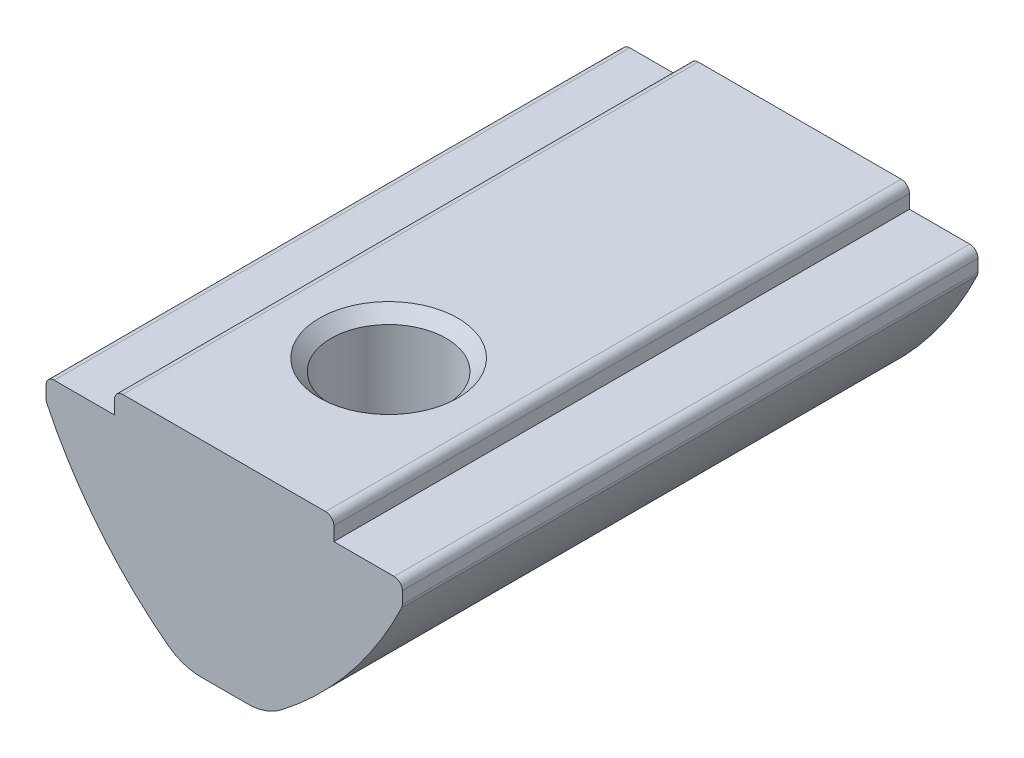
ISO-10303-21;
HEADER;
FILE_DESCRIPTION(('STEP AP214'),'2;1');
FILE_NAME('part.step','',(''),(''),'','','');
FILE_SCHEMA(('AUTOMOTIVE_DESIGN { 1 0 10303 214 1 1 1 1 }'));
ENDSEC;
DATA;
#1=APPLICATION_CONTEXT('core data for automotive mechanical design processes');
#2=APPLICATION_PROTOCOL_DEFINITION('international standard','automotive_design',2000,#1);
#3=PRODUCT_CONTEXT('',#1,'mechanical');
#4=PRODUCT('Part','Part','',(#3));
#5=PRODUCT_RELATED_PRODUCT_CATEGORY('part','',(#4));
#6=PRODUCT_DEFINITION_FORMATION('','',#4);
#7=PRODUCT_DEFINITION_CONTEXT('part definition',#1,'design');
#8=PRODUCT_DEFINITION('design','',#6,#7);
#9=PRODUCT_DEFINITION_SHAPE('','',#8);
#10=(LENGTH_UNIT() NAMED_UNIT(*) SI_UNIT(.MILLI.,.METRE.));
#11=(NAMED_UNIT(*) PLANE_ANGLE_UNIT() SI_UNIT($,.RADIAN.));
#12=(NAMED_UNIT(*) SI_UNIT($,.STERADIAN.) SOLID_ANGLE_UNIT());
#13=UNCERTAINTY_MEASURE_WITH_UNIT(LENGTH_MEASURE(1.E-05),#10,'distance_accuracy_value','');
#14=(GEOMETRIC_REPRESENTATION_CONTEXT(3) GLOBAL_UNCERTAINTY_ASSIGNED_CONTEXT((#13)) GLOBAL_UNIT_ASSIGNED_CONTEXT((#10,
#11,#12)) REPRESENTATION_CONTEXT('',''));
#15=CARTESIAN_POINT('',(0.,0.,0.));
#16=DIRECTION('',(0.,0.,1.));
#17=DIRECTION('',(1.,0.,0.));
#18=AXIS2_PLACEMENT_3D('',#15,#16,#17);
#19=CARTESIAN_POINT('',(-1.5,-7.5,10.5));
#20=DIRECTION('',(0.,1.,0.));
#21=DIRECTION('',(0.,0.,1.));
#22=AXIS2_PLACEMENT_3D('',#19,#20,#21);
#23=PLANE('',#22);
#24=DIRECTION('',(0.,0.,-1.));
#25=VECTOR('',#24,1.);
#26=CARTESIAN_POINT('',(0.84882059675723,-7.5,10.5));
#27=LINE('',#26,#25);
#28=CARTESIAN_POINT('',(0.84882059675723,-7.5,-10.5));
#29=VERTEX_POINT('',#28);
#30=CARTESIAN_POINT('',(0.84882059675723,-7.5,-7.85628300679493));
#31=VERTEX_POINT('',#30);
#32=EDGE_CURVE('E213',#29,#31,#27,.F.);
#33=ORIENTED_EDGE('',*,*,#32,.T.);
#34=CARTESIAN_POINT('',(0.,-7.5,-6.5));
#35=DIRECTION('',(0.,1.,0.));
#36=DIRECTION('',(0.,0.,1.));
#37=AXIS2_PLACEMENT_3D('',#34,#35,#36);
#38=CIRCLE('',#37,1.6);
#39=CARTESIAN_POINT('',(-0.84882059675723,-7.5,-7.85628300679494));
#40=VERTEX_POINT('',#39);
#41=EDGE_CURVE('E58',#31,#40,#38,.T.);
#42=ORIENTED_EDGE('',*,*,#41,.T.);
#43=DIRECTION('',(0.,0.,-1.));
#44=VECTOR('',#43,1.);
#45=CARTESIAN_POINT('',(-0.84882059675723,-7.5,10.5));
#46=LINE('',#45,#44);
#47=CARTESIAN_POINT('',(-0.84882059675723,-7.5,-10.5));
#48=VERTEX_POINT('',#47);
#49=EDGE_CURVE('E379',#40,#48,#46,.T.);
#50=ORIENTED_EDGE('',*,*,#49,.T.);
#51=DIRECTION('',(1.,0.,0.));
#52=VECTOR('',#51,1.);
#53=CARTESIAN_POINT('',(-1.5,-7.5,-10.5));
#54=LINE('',#53,#52);
#55=EDGE_CURVE('E466',#48,#29,#54,.T.);
#56=ORIENTED_EDGE('',*,*,#55,.T.);
#57=EDGE_LOOP('',(#33,#42,#50,#56));
#58=FACE_BOUND('',#57,.T.);
#59=ADVANCED_FACE('F37',(#58),#23,.F.);
#60=CARTESIAN_POINT('',(-0.84882059675723,-7.5,2.57919194230119));
#61=VERTEX_POINT('',#60);
#62=CARTESIAN_POINT('',(-0.84882059675723,-7.5,-5.14371699320506));
#63=VERTEX_POINT('',#62);
#64=EDGE_CURVE('E219',#61,#63,#46,.T.);
#65=ORIENTED_EDGE('',*,*,#64,.T.);
#66=CARTESIAN_POINT('',(0.84882059675723,-7.5,-5.14371699320507));
#67=VERTEX_POINT('',#66);
#68=EDGE_CURVE('E217',#63,#67,#38,.T.);
#69=ORIENTED_EDGE('',*,*,#68,.T.);
#70=CARTESIAN_POINT('',(0.84882059675723,-7.5,2.57919194230119));
#71=VERTEX_POINT('',#70);
#72=EDGE_CURVE('E205',#67,#71,#27,.F.);
#73=ORIENTED_EDGE('',*,*,#72,.T.);
#74=CARTESIAN_POINT('',(0.,-7.5,4.5));
#75=DIRECTION('',(0.,1.,0.));
#76=DIRECTION('',(0.,0.,1.));
#77=AXIS2_PLACEMENT_3D('',#74,#75,#76);
#78=CIRCLE('',#77,2.1);
#79=EDGE_CURVE('E546',#71,#61,#78,.T.);
#80=ORIENTED_EDGE('',*,*,#79,.T.);
#81=EDGE_LOOP('',(#65,#69,#73,#80));
#82=FACE_BOUND('',#81,.T.);
#83=ADVANCED_FACE('F218',(#82),#23,.F.);
#84=CARTESIAN_POINT('',(-0.84882059675723,-5.5,10.5));
#85=DIRECTION('',(0.,0.,-1.));
#86=DIRECTION('',(-1.,0.,0.));
#87=AXIS2_PLACEMENT_3D('',#84,#85,#86);
#88=CYLINDRICAL_SURFACE('',#87,2.);
#89=CARTESIAN_POINT('',(-0.84862059675723,-7.49999999,-5.14359183622355));
#90=CARTESIAN_POINT('',(-0.893920417374782,-7.50001597939785,-5.1719407315319));
#91=CARTESIAN_POINT('',(-0.938411665543847,-7.49847031841211,-5.20157310121503));
#92=CARTESIAN_POINT('',(-1.02536727830624,-7.49266619763591,-5.26346370014139));
#93=CARTESIAN_POINT('',(-1.06783093828147,-7.48840680205097,-5.29572283183958));
#94=CARTESIAN_POINT('',(-1.15058196715608,-7.47754793031724,-5.3631444221097));
#95=CARTESIAN_POINT('',(-1.19085178101182,-7.47093208484472,-5.39832583536386));
#96=CARTESIAN_POINT('',(-1.26841717204776,-7.45588891376005,-5.47143937434215));
#97=CARTESIAN_POINT('',(-1.30571349778757,-7.44746204604972,-5.50937080314435));
#98=CARTESIAN_POINT('',(-1.400673100004,-7.42332855740688,-5.61439144722884));
#99=CARTESIAN_POINT('',(-1.45530041175115,-7.40651913912559,-5.68403319287582));
#100=CARTESIAN_POINT('',(-1.55227512789681,-7.37290832688576,-5.83118215233379));
#101=CARTESIAN_POINT('',(-1.5946663503423,-7.35610712492865,-5.90865992374011));
#102=CARTESIAN_POINT('',(-1.65589549983114,-7.33015326755531,-6.05122785378434));
#103=CARTESIAN_POINT('',(-1.67795236402968,-7.32013387735501,-6.11476472107596));
#104=CARTESIAN_POINT('',(-1.71204388562128,-7.30421907875782,-6.24498489694868));
#105=CARTESIAN_POINT('',(-1.72408787769395,-7.29831983010756,-6.31166521355792));
#106=CARTESIAN_POINT('',(-1.73724099236442,-7.29186203768552,-6.44671795857442));
#107=CARTESIAN_POINT('',(-1.73829597266998,-7.29132993798517,-6.51509710287791));
#108=CARTESIAN_POINT('',(-1.72923200837907,-7.29579993929629,-6.65092865556945));
#109=CARTESIAN_POINT('',(-1.71910897628651,-7.3008040647565,-6.71838071581356));
#110=CARTESIAN_POINT('',(-1.68954026321085,-7.31478083529031,-6.84601911935351));
#111=CARTESIAN_POINT('',(-1.67074609314059,-7.32347318191401,-6.90639235362659));
#112=CARTESIAN_POINT('',(-1.62523242319014,-7.34331257713247,-7.02361961096726));
#113=CARTESIAN_POINT('',(-1.59850827832768,-7.35446106342243,-7.08047154777786));
#114=CARTESIAN_POINT('',(-1.52205364552012,-7.38393190387619,-7.21973230748937));
#115=CARTESIAN_POINT('',(-1.46767727087186,-7.40288997520654,-7.29945773798883));
#116=CARTESIAN_POINT('',(-1.34636969879211,-7.43815652252946,-7.44949920798115));
#117=CARTESIAN_POINT('',(-1.27940762800804,-7.45445829488339,-7.51979136451));
#118=CARTESIAN_POINT('',(-1.15252276724061,-7.47760241382482,-7.63606572297524));
#119=CARTESIAN_POINT('',(-1.09453123398406,-7.48575872197645,-7.6839180532923));
#120=CARTESIAN_POINT('',(-0.974420444333699,-7.49697001250135,-7.77413863930349));
#121=CARTESIAN_POINT('',(-0.912322946277687,-7.50004994530099,-7.81653276756944));
#122=CARTESIAN_POINT('',(-0.84862059675723,-7.49999999,-7.85640816377645));
#123=B_SPLINE_CURVE_WITH_KNOTS('',3,(#89,#90,#91,#92,#93,#94,#95,#96,#97,#98,#99,#100,#101,#102,
#103,#104,#105,#106,#107,#108,#109,#110,#111,#112,#113,#114,#115,#116,#117,#118,#119,#120,#121,
#122),.UNSPECIFIED.,.F.,.F.,(4,2,2,2,2,2,2,2,2,2,2,2,2,2,2,2,4),(0.,0.160266074880731,
0.320587445272625,0.482044950159162,0.643461679794423,0.912696961225031,1.18095578400885,
1.38415001995781,1.5871546113343,1.79115892549288,1.9952378632099,2.18599856740733,
2.37687123099049,2.6703129257304,2.96448407161075,3.19089694141928,3.41619363507759),.UNSPECIFIED.);
#124=EDGE_CURVE('E65',#63,#40,#123,.T.);
#125=ORIENTED_EDGE('',*,*,#124,.F.);
#126=ORIENTED_EDGE('',*,*,#64,.F.);
#127=CARTESIAN_POINT('',(-2.06504804382504,-7.08769984474361,4.1184550135379));
#128=CARTESIAN_POINT('',(-2.05431327245101,-7.09590837456537,4.06035457869994));
#129=CARTESIAN_POINT('',(-2.04118229509858,-7.10580997544555,4.00300839741501));
#130=CARTESIAN_POINT('',(-2.01035368175849,-7.12825547177066,3.89016901715076));
#131=CARTESIAN_POINT('',(-1.99266237163313,-7.14079570264975,3.83467337068317));
#132=CARTESIAN_POINT('',(-1.9329928227217,-7.18132997116211,3.67113544186049));
#133=CARTESIAN_POINT('',(-1.88444031096008,-7.21221907553111,3.56615446553112));
#134=CARTESIAN_POINT('',(-1.77147688917298,-7.27563915965422,3.36641491487496));
#135=CARTESIAN_POINT('',(-1.70712941909923,-7.30816316720682,3.2716175758889));
#136=CARTESIAN_POINT('',(-1.56332148002834,-7.36964457273043,3.09320665847536));
#137=CARTESIAN_POINT('',(-1.48390677980606,-7.39861234532236,3.00956048424104));
#138=CARTESIAN_POINT('',(-1.35745193007548,-7.43469209434834,2.89681295536197));
#139=CARTESIAN_POINT('',(-1.31590303137079,-7.44519148207398,2.86252576117711));
#140=CARTESIAN_POINT('',(-1.22995771993922,-7.46383954673171,2.79702620936512));
#141=CARTESIAN_POINT('',(-1.18556260435066,-7.47198928531678,2.76581246725694));
#142=CARTESIAN_POINT('',(-1.09378494999168,-7.48548690553284,2.70650063390777));
#143=CARTESIAN_POINT('',(-1.04638059367441,-7.49081086541139,2.67843068269694));
#144=CARTESIAN_POINT('',(-0.949237382073811,-7.49807492905879,2.62596260744769));
#145=CARTESIAN_POINT('',(-0.899494779953074,-7.50000939752379,2.60157065979072));
#146=CARTESIAN_POINT('',(-0.84882059675723,-7.5,2.57919194230118));
#147=B_SPLINE_CURVE_WITH_KNOTS('',3,(#127,#128,#129,#130,#131,#132,#133,#134,#135,#136,#137,
#138,#139,#140,#141,#142,#143,#144,#145,#146),.UNSPECIFIED.,.F.,.F.,(4,2,2,2,2,2,2,2,2,4),(0.,
0.178762546896584,0.357278445490748,0.71465261925224,1.07061424666698,1.42551141938199,
1.58999225250856,1.75439865060015,1.92017549322351,2.08622769266774),.UNSPECIFIED.);
#148=CARTESIAN_POINT('',(-2.06504804382504,-7.08769984474362,4.1184550135379));
#149=VERTEX_POINT('',#148);
#150=EDGE_CURVE('E285',#149,#61,#147,.T.);
#151=ORIENTED_EDGE('',*,*,#150,.F.);
#152=DIRECTION('',(0.,0.,-1.));
#153=VECTOR('',#152,1.);
#154=CARTESIAN_POINT('',(-2.06504804382504,-7.08769984474362,10.5));
#155=LINE('',#154,#153);
#156=CARTESIAN_POINT('',(-2.06504804382504,-7.08769984474362,-10.5));
#157=VERTEX_POINT('',#156);
#158=EDGE_CURVE('E543',#157,#149,#155,.F.);
#159=ORIENTED_EDGE('',*,*,#158,.F.);
#160=CARTESIAN_POINT('',(-0.84882059675723,-5.5,-10.5));
#161=DIRECTION('',(0.,0.,1.));
#162=DIRECTION('',(1.,0.,0.));
#163=AXIS2_PLACEMENT_3D('',#160,#161,#162);
#164=CIRCLE('',#163,2.);
#165=EDGE_CURVE('E384',#48,#157,#164,.F.);
#166=ORIENTED_EDGE('',*,*,#165,.F.);
#167=ORIENTED_EDGE('',*,*,#49,.F.);
#168=EDGE_LOOP('',(#125,#126,#151,#159,#166,#167));
#169=FACE_BOUND('',#168,.T.);
#170=ADVANCED_FACE('F352',(#169),#88,.T.);
#171=CARTESIAN_POINT('',(0.84882059675723,-5.5,10.5));
#172=DIRECTION('',(0.,0.,-1.));
#173=DIRECTION('',(-1.,0.,0.));
#174=AXIS2_PLACEMENT_3D('',#171,#172,#173);
#175=CYLINDRICAL_SURFACE('',#174,2.);
#176=CARTESIAN_POINT('',(0.84862059675723,-7.49999999,-7.85640816377645));
#177=CARTESIAN_POINT('',(0.893920417374782,-7.50001597939785,-7.8280592684681));
#178=CARTESIAN_POINT('',(0.938411665543847,-7.49847031841211,-7.79842689878497));
#179=CARTESIAN_POINT('',(1.02536727830624,-7.49266619763591,-7.73653629985861));
#180=CARTESIAN_POINT('',(1.06783093828147,-7.48840680205097,-7.70427716816043));
#181=CARTESIAN_POINT('',(1.15058196715608,-7.47754793031724,-7.6368555778903));
#182=CARTESIAN_POINT('',(1.19085178101182,-7.47093208484472,-7.60167416463615));
#183=CARTESIAN_POINT('',(1.26841717204776,-7.45588891376005,-7.52856062565786));
#184=CARTESIAN_POINT('',(1.30571349778757,-7.44746204604972,-7.49062919685565));
#185=CARTESIAN_POINT('',(1.40067310000399,-7.42332855740688,-7.38560855277116));
#186=CARTESIAN_POINT('',(1.45530041175114,-7.40651913912559,-7.31596680712418));
#187=CARTESIAN_POINT('',(1.5522751278968,-7.37290832688577,-7.16881784766621));
#188=CARTESIAN_POINT('',(1.5946663503423,-7.35610712492865,-7.09134007625989));
#189=CARTESIAN_POINT('',(1.65589549983113,-7.33015326755531,-6.94877214621567));
#190=CARTESIAN_POINT('',(1.67795236402968,-7.32013387735502,-6.88523527892405));
#191=CARTESIAN_POINT('',(1.71204388562128,-7.30421907875782,-6.75501510305133));
#192=CARTESIAN_POINT('',(1.72408787769395,-7.29831983010756,-6.68833478644209));
#193=CARTESIAN_POINT('',(1.73724099236442,-7.29186203768552,-6.55328204142559));
#194=CARTESIAN_POINT('',(1.73829597266998,-7.29132993798517,-6.4849028971221));
#195=CARTESIAN_POINT('',(1.72923200837907,-7.29579993929629,-6.34907134443056));
#196=CARTESIAN_POINT('',(1.71910897628651,-7.3008040647565,-6.28161928418645));
#197=CARTESIAN_POINT('',(1.68954026321085,-7.31478083529031,-6.1539808806465));
#198=CARTESIAN_POINT('',(1.67074609314059,-7.32347318191401,-6.09360764637342));
#199=CARTESIAN_POINT('',(1.62523242319015,-7.34331257713247,-5.97638038903274));
#200=CARTESIAN_POINT('',(1.59850827832768,-7.35446106342243,-5.91952845222215));
#201=CARTESIAN_POINT('',(1.52205364552012,-7.38393190387619,-5.78026769251063));
#202=CARTESIAN_POINT('',(1.46767727087186,-7.40288997520653,-5.70054226201118));
#203=CARTESIAN_POINT('',(1.34636969879211,-7.43815652252946,-5.55050079201886));
#204=CARTESIAN_POINT('',(1.27940762800804,-7.45445829488339,-5.48020863549001));
#205=CARTESIAN_POINT('',(1.15252276724061,-7.47760241382482,-5.36393427702477));
#206=CARTESIAN_POINT('',(1.09453123398406,-7.48575872197645,-5.3160819467077));
#207=CARTESIAN_POINT('',(0.9744204443337,-7.49697001250135,-5.22586136069651));
#208=CARTESIAN_POINT('',(0.912322946277686,-7.50004994530099,-5.18346723243056));
#209=CARTESIAN_POINT('',(0.848620596757229,-7.49999999,-5.14359183622355));
#210=B_SPLINE_CURVE_WITH_KNOTS('',3,(#176,#177,#178,#179,#180,#181,#182,#183,#184,#185,#186,
#187,#188,#189,#190,#191,#192,#193,#194,#195,#196,#197,#198,#199,#200,#201,#202,#203,#204,#205,
#206,#207,#208,#209),.UNSPECIFIED.,.F.,.F.,(4,2,2,2,2,2,2,2,2,2,2,2,2,2,2,2,4),(0.,
0.160266074880731,0.320587445272624,0.48204495015916,0.64346167979442,0.912696961225026,
1.18095578400885,1.3841500199578,1.5871546113343,1.79115892549288,1.99523786320989,
2.18599856740732,2.37687123099049,2.67031292573039,2.96448407161075,3.19089694141928,
3.41619363507759),.UNSPECIFIED.);
#211=EDGE_CURVE('E11',#31,#67,#210,.T.);
#212=ORIENTED_EDGE('',*,*,#211,.F.);
#213=ORIENTED_EDGE('',*,*,#32,.F.);
#214=CARTESIAN_POINT('',(0.84882059675723,-5.5,-10.5));
#215=DIRECTION('',(0.,0.,1.));
#216=DIRECTION('',(1.,0.,0.));
#217=AXIS2_PLACEMENT_3D('',#214,#215,#216);
#218=CIRCLE('',#217,2.);
#219=CARTESIAN_POINT('',(2.06504804382504,-7.08769984474362,-10.5));
#220=VERTEX_POINT('',#219);
#221=EDGE_CURVE('E381',#220,#29,#218,.F.);
#222=ORIENTED_EDGE('',*,*,#221,.F.);
#223=DIRECTION('',(0.,0.,-1.));
#224=VECTOR('',#223,1.);
#225=CARTESIAN_POINT('',(2.06504804382504,-7.08769984474362,10.5));
#226=LINE('',#225,#224);
#227=CARTESIAN_POINT('',(2.06504804382505,-7.08769984474361,4.11845501353793));
#228=VERTEX_POINT('',#227);
#229=EDGE_CURVE('E394',#228,#220,#226,.T.);
#230=ORIENTED_EDGE('',*,*,#229,.F.);
#231=CARTESIAN_POINT('',(0.84882059675723,-7.5,2.57919194230119));
#232=CARTESIAN_POINT('',(0.897772381053107,-7.50000837414881,2.60081118304732));
#233=CARTESIAN_POINT('',(0.945857606216162,-7.49820350921603,2.62430905725749));
#234=CARTESIAN_POINT('',(1.03986211676657,-7.49140935360983,2.67475630032645));
#235=CARTESIAN_POINT('',(1.0857844698205,-7.48642472847583,2.70170056619642));
#236=CARTESIAN_POINT('',(1.17478798636148,-7.47376573339116,2.75855194104269));
#237=CARTESIAN_POINT('',(1.21789034757692,-7.46611508068648,2.78843130903511));
#238=CARTESIAN_POINT('',(1.30145986456577,-7.44857447155278,2.8510814479611));
#239=CARTESIAN_POINT('',(1.3419260451082,-7.43868369239903,2.88385327849539));
#240=CARTESIAN_POINT('',(1.45864702318622,-7.40646052570602,2.98574714634796));
#241=CARTESIAN_POINT('',(1.53079479165038,-7.38148508660855,3.05881543257144));
#242=CARTESIAN_POINT('',(1.66335645835161,-7.32802402004544,3.21402521322999));
#243=CARTESIAN_POINT('',(1.72373046904108,-7.2995269768466,3.2961961208466));
#244=CARTESIAN_POINT('',(1.84763566685972,-7.23451475578938,3.49333258174427));
#245=CARTESIAN_POINT('',(1.9071040999495,-7.1980445653894,3.61094372498032));
#246=CARTESIAN_POINT('',(1.9794182402948,-7.15003056686114,3.79553497984485));
#247=CARTESIAN_POINT('',(2.00070956042286,-7.13513989443422,3.85843490569623));
#248=CARTESIAN_POINT('',(2.03739542776442,-7.10865867667093,3.98670228450613));
#249=CARTESIAN_POINT('',(2.05278081041075,-7.09707326738803,4.05207340088176));
#250=CARTESIAN_POINT('',(2.06504804382504,-7.08769984474362,4.11845501353791));
#251=B_SPLINE_CURVE_WITH_KNOTS('',3,(#231,#232,#233,#234,#235,#236,#237,#238,#239,#240,#241,
#242,#243,#244,#245,#246,#247,#248,#249,#250),.UNSPECIFIED.,.F.,.F.,(4,2,2,2,2,2,2,2,2,4),(0.,
0.160420219550008,0.320605600406323,0.479400877531711,0.638254569781294,0.953931059672706,
1.27065910687127,1.67824703406851,1.88208411467945,2.08623623400432),.UNSPECIFIED.);
#252=EDGE_CURVE('E51',#71,#228,#251,.T.);
#253=ORIENTED_EDGE('',*,*,#252,.F.);
#254=ORIENTED_EDGE('',*,*,#72,.F.);
#255=EDGE_LOOP('',(#212,#213,#222,#230,#253,#254));
#256=FACE_BOUND('',#255,.T.);
#257=ADVANCED_FACE('F207',(#256),#175,.T.);
#258=CARTESIAN_POINT('',(4.,0.,10.5));
#259=DIRECTION('',(-1.,0.,0.));
#260=DIRECTION('',(0.,0.,1.));
#261=AXIS2_PLACEMENT_3D('',#258,#259,#260);
#262=PLANE('',#261);
#263=DIRECTION('',(0.,1.,0.));
#264=VECTOR('',#263,1.);
#265=CARTESIAN_POINT('',(4.,0.,-10.5));
#266=LINE('',#265,#264);
#267=CARTESIAN_POINT('',(4.,-0.799999999999998,-10.5));
#268=VERTEX_POINT('',#267);
#269=CARTESIAN_POINT('',(4.,-0.3,-10.5));
#270=VERTEX_POINT('',#269);
#271=EDGE_CURVE('E482',#268,#270,#266,.T.);
#272=ORIENTED_EDGE('',*,*,#271,.T.);
#273=DIRECTION('',(0.,0.,-1.));
#274=VECTOR('',#273,1.);
#275=CARTESIAN_POINT('',(4.,-0.3,10.5));
#276=LINE('',#275,#274);
#277=CARTESIAN_POINT('',(4.,-0.3,10.5));
#278=VERTEX_POINT('',#277);
#279=EDGE_CURVE('E431',#270,#278,#276,.F.);
#280=ORIENTED_EDGE('',*,*,#279,.T.);
#281=DIRECTION('',(0.,1.,0.));
#282=VECTOR('',#281,1.);
#283=CARTESIAN_POINT('',(4.,0.,10.5));
#284=LINE('',#283,#282);
#285=CARTESIAN_POINT('',(4.,-0.799999999999998,10.5));
#286=VERTEX_POINT('',#285);
#287=EDGE_CURVE('E460',#286,#278,#284,.T.);
#288=ORIENTED_EDGE('',*,*,#287,.F.);
#289=DIRECTION('',(0.,0.,-1.));
#290=VECTOR('',#289,1.);
#291=CARTESIAN_POINT('',(4.,-0.799999999999998,10.5));
#292=LINE('',#291,#290);
#293=EDGE_CURVE('E454',#286,#268,#292,.T.);
#294=ORIENTED_EDGE('',*,*,#293,.T.);
#295=EDGE_LOOP('',(#272,#280,#288,#294));
#296=FACE_BOUND('',#295,.T.);
#297=ADVANCED_FACE('F313',(#296),#262,.F.);
#298=CARTESIAN_POINT('',(-4.,0.,10.5));
#299=DIRECTION('',(0.,-1.,0.));
#300=DIRECTION('',(0.,0.,-1.));
#301=AXIS2_PLACEMENT_3D('',#298,#299,#300);
#302=PLANE('',#301);
#303=CARTESIAN_POINT('',(0.,0.,4.5));
#304=DIRECTION('',(0.,1.,0.));
#305=DIRECTION('',(0.,0.,1.));
#306=AXIS2_PLACEMENT_3D('',#303,#304,#305);
#307=CIRCLE('',#306,2.525);
#308=CARTESIAN_POINT('',(0.,0.,7.025));
#309=VERTEX_POINT('',#308);
#310=EDGE_CURVE('E223',#309,#309,#307,.T.);
#311=ORIENTED_EDGE('',*,*,#310,.F.);
#312=EDGE_LOOP('',(#311));
#313=FACE_BOUND('',#312,.T.);
#314=DIRECTION('',(-1.,0.,0.));
#315=VECTOR('',#314,1.);
#316=CARTESIAN_POINT('',(-4.,0.,10.5));
#317=LINE('',#316,#315);
#318=CARTESIAN_POINT('',(3.7,0.,10.5));
#319=VERTEX_POINT('',#318);
#320=CARTESIAN_POINT('',(-3.7,0.,10.5));
#321=VERTEX_POINT('',#320);
#322=EDGE_CURVE('E503',#319,#321,#317,.T.);
#323=ORIENTED_EDGE('',*,*,#322,.F.);
#324=DIRECTION('',(0.,0.,-1.));
#325=VECTOR('',#324,1.);
#326=CARTESIAN_POINT('',(3.7,0.,10.5));
#327=LINE('',#326,#325);
#328=CARTESIAN_POINT('',(3.7,0.,-10.5));
#329=VERTEX_POINT('',#328);
#330=EDGE_CURVE('E446',#319,#329,#327,.T.);
#331=ORIENTED_EDGE('',*,*,#330,.T.);
#332=DIRECTION('',(-1.,0.,0.));
#333=VECTOR('',#332,1.);
#334=CARTESIAN_POINT('',(-4.,0.,-10.5));
#335=LINE('',#334,#333);
#336=CARTESIAN_POINT('',(-3.7,0.,-10.5));
#337=VERTEX_POINT('',#336);
#338=EDGE_CURVE('E479',#329,#337,#335,.T.);
#339=ORIENTED_EDGE('',*,*,#338,.T.);
#340=DIRECTION('',(0.,0.,-1.));
#341=VECTOR('',#340,1.);
#342=CARTESIAN_POINT('',(-3.7,0.,10.5));
#343=LINE('',#342,#341);
#344=EDGE_CURVE('E449',#337,#321,#343,.F.);
#345=ORIENTED_EDGE('',*,*,#344,.T.);
#346=EDGE_LOOP('',(#323,#331,#339,#345));
#347=FACE_BOUND('',#346,.T.);
#348=ADVANCED_FACE('F309',(#313,#347),#302,.F.);
#349=CARTESIAN_POINT('',(-4.,0.,10.5));
#350=DIRECTION('',(1.,0.,0.));
#351=DIRECTION('',(0.,0.,-1.));
#352=AXIS2_PLACEMENT_3D('',#349,#350,#351);
#353=PLANE('',#352);
#354=DIRECTION('',(0.,-1.,0.));
#355=VECTOR('',#354,1.);
#356=CARTESIAN_POINT('',(-4.,0.,10.5));
#357=LINE('',#356,#355);
#358=CARTESIAN_POINT('',(-4.,-0.3,10.5));
#359=VERTEX_POINT('',#358);
#360=CARTESIAN_POINT('',(-4.,-0.8,10.5));
#361=VERTEX_POINT('',#360);
#362=EDGE_CURVE('E501',#359,#361,#357,.T.);
#363=ORIENTED_EDGE('',*,*,#362,.F.);
#364=DIRECTION('',(0.,0.,-1.));
#365=VECTOR('',#364,1.);
#366=CARTESIAN_POINT('',(-4.,-0.3,10.5));
#367=LINE('',#366,#365);
#368=CARTESIAN_POINT('',(-4.,-0.3,-10.5));
#369=VERTEX_POINT('',#368);
#370=EDGE_CURVE('E416',#359,#369,#367,.T.);
#371=ORIENTED_EDGE('',*,*,#370,.T.);
#372=DIRECTION('',(0.,-1.,0.));
#373=VECTOR('',#372,1.);
#374=CARTESIAN_POINT('',(-4.,0.,-10.5));
#375=LINE('',#374,#373);
#376=CARTESIAN_POINT('',(-4.,-0.8,-10.5));
#377=VERTEX_POINT('',#376);
#378=EDGE_CURVE('E477',#369,#377,#375,.T.);
#379=ORIENTED_EDGE('',*,*,#378,.T.);
#380=DIRECTION('',(0.,0.,-1.));
#381=VECTOR('',#380,1.);
#382=CARTESIAN_POINT('',(-4.,-0.8,10.5));
#383=LINE('',#382,#381);
#384=EDGE_CURVE('E451',#361,#377,#383,.T.);
#385=ORIENTED_EDGE('',*,*,#384,.F.);
#386=EDGE_LOOP('',(#363,#371,#379,#385));
#387=FACE_BOUND('',#386,.T.);
#388=ADVANCED_FACE('F305',(#387),#353,.F.);
#389=CARTESIAN_POINT('',(-4.,-0.8,10.5));
#390=DIRECTION('',(0.,-1.,0.));
#391=DIRECTION('',(1.,0.,0.));
#392=AXIS2_PLACEMENT_3D('',#389,#390,#391);
#393=PLANE('',#392);
#394=DIRECTION('',(-1.,0.,0.));
#395=VECTOR('',#394,1.);
#396=CARTESIAN_POINT('',(-4.,-0.8,-10.5));
#397=LINE('',#396,#395);
#398=CARTESIAN_POINT('',(-6.2,-0.8,-10.5));
#399=VERTEX_POINT('',#398);
#400=EDGE_CURVE('E474',#377,#399,#397,.T.);
#401=ORIENTED_EDGE('',*,*,#400,.T.);
#402=DIRECTION('',(0.,0.,-1.));
#403=VECTOR('',#402,1.);
#404=CARTESIAN_POINT('',(-6.2,-0.8,10.5));
#405=LINE('',#404,#403);
#406=CARTESIAN_POINT('',(-6.2,-0.8,10.5));
#407=VERTEX_POINT('',#406);
#408=EDGE_CURVE('E398',#399,#407,#405,.F.);
#409=ORIENTED_EDGE('',*,*,#408,.T.);
#410=DIRECTION('',(-1.,0.,0.));
#411=VECTOR('',#410,1.);
#412=CARTESIAN_POINT('',(-4.,-0.8,10.5));
#413=LINE('',#412,#411);
#414=EDGE_CURVE('E498',#361,#407,#413,.T.);
#415=ORIENTED_EDGE('',*,*,#414,.F.);
#416=ORIENTED_EDGE('',*,*,#384,.T.);
#417=EDGE_LOOP('',(#401,#409,#415,#416));
#418=FACE_BOUND('',#417,.T.);
#419=ADVANCED_FACE('F301',(#418),#393,.F.);
#420=CARTESIAN_POINT('',(-6.5,-0.8,10.5));
#421=DIRECTION('',(1.,0.,0.));
#422=DIRECTION('',(0.,1.,0.));
#423=AXIS2_PLACEMENT_3D('',#420,#421,#422);
#424=PLANE('',#423);
#425=DIRECTION('',(0.,-1.,0.));
#426=VECTOR('',#425,1.);
#427=CARTESIAN_POINT('',(-6.5,-0.8,10.5));
#428=LINE('',#427,#426);
#429=CARTESIAN_POINT('',(-6.5,-1.1,10.5));
#430=VERTEX_POINT('',#429);
#431=CARTESIAN_POINT('',(-6.5,-1.53219657512287,10.5));
#432=VERTEX_POINT('',#431);
#433=EDGE_CURVE('E495',#430,#432,#428,.T.);
#434=ORIENTED_EDGE('',*,*,#433,.F.);
#435=DIRECTION('',(0.,0.,-1.));
#436=VECTOR('',#435,1.);
#437=CARTESIAN_POINT('',(-6.5,-1.1,10.5));
#438=LINE('',#437,#436);
#439=CARTESIAN_POINT('',(-6.5,-1.1,-10.5));
#440=VERTEX_POINT('',#439);
#441=EDGE_CURVE('E400',#430,#440,#438,.T.);
#442=ORIENTED_EDGE('',*,*,#441,.T.);
#443=DIRECTION('',(0.,-1.,0.));
#444=VECTOR('',#443,1.);
#445=CARTESIAN_POINT('',(-6.5,-0.8,-10.5));
#446=LINE('',#445,#444);
#447=CARTESIAN_POINT('',(-6.5,-1.53219657512287,-10.5));
#448=VERTEX_POINT('',#447);
#449=EDGE_CURVE('E471',#440,#448,#446,.T.);
#450=ORIENTED_EDGE('',*,*,#449,.T.);
#451=DIRECTION('',(0.,0.,-1.));
#452=VECTOR('',#451,1.);
#453=CARTESIAN_POINT('',(-6.5,-1.53219657512287,10.5));
#454=LINE('',#453,#452);
#455=EDGE_CURVE('E403',#448,#432,#454,.F.);
#456=ORIENTED_EDGE('',*,*,#455,.T.);
#457=EDGE_LOOP('',(#434,#442,#450,#456));
#458=FACE_BOUND('',#457,.T.);
#459=ADVANCED_FACE('F297',(#458),#424,.F.);
#460=CARTESIAN_POINT('',(7.05665780918356,4.82004899083352,10.5));
#461=DIRECTION('',(0.,0.,-1.));
#462=DIRECTION('',(-1.,0.,0.));
#463=AXIS2_PLACEMENT_3D('',#460,#461,#462);
#464=CYLINDRICAL_SURFACE('',#463,15.);
#465=ORIENTED_EDGE('',*,*,#158,.T.);
#466=CARTESIAN_POINT('',(-2.06504804382504,-7.08769984474362,4.1184550135379));
#467=CARTESIAN_POINT('',(-2.07365320902217,-7.08110596156904,4.16498057308031));
#468=CARTESIAN_POINT('',(-2.08069993448124,-7.0756951000462,4.21196755471384));
#469=CARTESIAN_POINT('',(-2.09160765408706,-7.06730982747579,4.30652503482274));
#470=CARTESIAN_POINT('',(-2.09546860577072,-7.06433544890404,4.35409554106731));
#471=CARTESIAN_POINT('',(-2.09989333129555,-7.06092636695584,4.44857495363839));
#472=CARTESIAN_POINT('',(-2.10051825092903,-7.06044456575125,4.49547929620003));
#473=CARTESIAN_POINT('',(-2.09862839054639,-7.06190105582878,4.58918169731741));
#474=CARTESIAN_POINT('',(-2.09611416295431,-7.06383892130034,4.63597977312211));
#475=CARTESIAN_POINT('',(-2.08912937277491,-7.06921465883806,4.71602754002453));
#476=CARTESIAN_POINT('',(-2.08540824054106,-7.07207711089425,4.74938465540185));
#477=CARTESIAN_POINT('',(-2.07639693341665,-7.07899890200946,4.81575045520098));
#478=CARTESIAN_POINT('',(-2.07110725454627,-7.08305786269517,4.8487592463609));
#479=CARTESIAN_POINT('',(-2.06504804382504,-7.08769984474361,4.8815449864621));
#480=B_SPLINE_CURVE_WITH_KNOTS('',3,(#466,#467,#468,#469,#470,#471,#472,#473,#474,#475,#476,
#477,#478,#479),.UNSPECIFIED.,.F.,.F.,(4,2,2,2,2,2,4),(0.,0.143282593370391,0.286567096519734,
0.427134050455413,0.56767627104325,0.668677157948437,0.769646139427479),.UNSPECIFIED.);
#481=CARTESIAN_POINT('',(-2.06504804382504,-7.08769984474361,4.8815449864621));
#482=VERTEX_POINT('',#481);
#483=EDGE_CURVE('E278',#149,#482,#480,.T.);
#484=ORIENTED_EDGE('',*,*,#483,.T.);
#485=CARTESIAN_POINT('',(-2.06504804382504,-7.08769984474362,10.5));
#486=VERTEX_POINT('',#485);
#487=EDGE_CURVE('E538',#482,#486,#155,.F.);
#488=ORIENTED_EDGE('',*,*,#487,.T.);
#489=CARTESIAN_POINT('',(7.05665780918356,4.82004899083352,10.5));
#490=DIRECTION('',(0.,0.,1.));
#491=DIRECTION('',(1.,0.,0.));
#492=AXIS2_PLACEMENT_3D('',#489,#490,#491);
#493=CIRCLE('',#492,15.);
#494=CARTESIAN_POINT('',(-6.47054403692211,-1.66183423973423,10.5));
#495=VERTEX_POINT('',#494);
#496=EDGE_CURVE('E492',#495,#486,#493,.T.);
#497=ORIENTED_EDGE('',*,*,#496,.F.);
#498=DIRECTION('',(0.,0.,-1.));
#499=VECTOR('',#498,1.);
#500=CARTESIAN_POINT('',(-6.47054403692211,-1.66183423973423,10.5));
#501=LINE('',#500,#499);
#502=CARTESIAN_POINT('',(-6.47054403692211,-1.66183423973423,-10.5));
#503=VERTEX_POINT('',#502);
#504=EDGE_CURVE('E395',#495,#503,#501,.T.);
#505=ORIENTED_EDGE('',*,*,#504,.T.);
#506=CARTESIAN_POINT('',(7.05665780918356,4.82004899083352,-10.5));
#507=DIRECTION('',(0.,0.,1.));
#508=DIRECTION('',(1.,0.,0.));
#509=AXIS2_PLACEMENT_3D('',#506,#507,#508);
#510=CIRCLE('',#509,15.);
#511=EDGE_CURVE('E468',#503,#157,#510,.T.);
#512=ORIENTED_EDGE('',*,*,#511,.T.);
#513=EDGE_LOOP('',(#465,#484,#488,#497,#505,#512));
#514=FACE_BOUND('',#513,.T.);
#515=ADVANCED_FACE('F291',(#514),#464,.T.);
#516=CARTESIAN_POINT('',(-0.84882059675723,-7.5,10.5));
#517=VERTEX_POINT('',#516);
#518=CARTESIAN_POINT('',(-0.84882059675723,-7.5,6.42080805769882));
#519=VERTEX_POINT('',#518);
#520=EDGE_CURVE('E371',#517,#519,#46,.T.);
#521=ORIENTED_EDGE('',*,*,#520,.T.);
#522=CARTESIAN_POINT('',(0.84882059675723,-7.5,6.42080805769882));
#523=VERTEX_POINT('',#522);
#524=EDGE_CURVE('E372',#519,#523,#78,.T.);
#525=ORIENTED_EDGE('',*,*,#524,.T.);
#526=CARTESIAN_POINT('',(0.84882059675723,-7.5,10.5));
#527=VERTEX_POINT('',#526);
#528=EDGE_CURVE('E214',#523,#527,#27,.F.);
#529=ORIENTED_EDGE('',*,*,#528,.T.);
#530=DIRECTION('',(1.,0.,0.));
#531=VECTOR('',#530,1.);
#532=CARTESIAN_POINT('',(-1.5,-7.5,10.5));
#533=LINE('',#532,#531);
#534=EDGE_CURVE('E375',#517,#527,#533,.T.);
#535=ORIENTED_EDGE('',*,*,#534,.F.);
#536=EDGE_LOOP('',(#521,#525,#529,#535));
#537=FACE_BOUND('',#536,.T.);
#538=ADVANCED_FACE('F296',(#537),#23,.F.);
#539=CARTESIAN_POINT('',(-7.05665780918356,4.82004899083352,10.5));
#540=DIRECTION('',(0.,0.,-1.));
#541=DIRECTION('',(-1.,0.,0.));
#542=AXIS2_PLACEMENT_3D('',#539,#540,#541);
#543=CYLINDRICAL_SURFACE('',#542,15.);
#544=CARTESIAN_POINT('',(2.06504804382504,-7.08769984474362,10.5));
#545=VERTEX_POINT('',#544);
#546=CARTESIAN_POINT('',(2.06504804382504,-7.08769984474362,4.88154498646209));
#547=VERTEX_POINT('',#546);
#548=EDGE_CURVE('E389',#545,#547,#226,.T.);
#549=ORIENTED_EDGE('',*,*,#548,.T.);
#550=CARTESIAN_POINT('',(2.06504804382505,-7.08769984474361,4.88154498646207));
#551=CARTESIAN_POINT('',(2.07365320902218,-7.08110596156904,4.83501942691966));
#552=CARTESIAN_POINT('',(2.08069993448124,-7.0756951000462,4.78803244528613));
#553=CARTESIAN_POINT('',(2.09160765408706,-7.06730982747579,4.69347496517724));
#554=CARTESIAN_POINT('',(2.09546860577072,-7.06433544890404,4.64590445893266));
#555=CARTESIAN_POINT('',(2.09989333129555,-7.06092636695584,4.55142504636159));
#556=CARTESIAN_POINT('',(2.10051825092903,-7.06044456575125,4.50452070379994));
#557=CARTESIAN_POINT('',(2.09862839054639,-7.06190105582878,4.41081830268256));
#558=CARTESIAN_POINT('',(2.09611416295431,-7.06383892130034,4.36402022687786));
#559=CARTESIAN_POINT('',(2.0891293727749,-7.06921465883806,4.28397245997545));
#560=CARTESIAN_POINT('',(2.08540824054106,-7.07207711089425,4.25061534459814));
#561=CARTESIAN_POINT('',(2.07639693341665,-7.07899890200946,4.18424954479903));
#562=CARTESIAN_POINT('',(2.07110725454628,-7.08305786269516,4.15124075363912));
#563=CARTESIAN_POINT('',(2.06504804382505,-7.08769984474361,4.11845501353793));
#564=B_SPLINE_CURVE_WITH_KNOTS('',3,(#550,#551,#552,#553,#554,#555,#556,#557,#558,#559,#560,
#561,#562,#563),.UNSPECIFIED.,.F.,.F.,(4,2,2,2,2,2,4),(0.,0.143282593370391,0.286567096519734,
0.427134050455413,0.567676271043249,0.668677157948409,0.769646139427422),.UNSPECIFIED.);
#565=EDGE_CURVE('E264',#547,#228,#564,.T.);
#566=ORIENTED_EDGE('',*,*,#565,.T.);
#567=ORIENTED_EDGE('',*,*,#229,.T.);
#568=CARTESIAN_POINT('',(-7.05665780918356,4.82004899083352,-10.5));
#569=DIRECTION('',(0.,0.,1.));
#570=DIRECTION('',(1.,0.,0.));
#571=AXIS2_PLACEMENT_3D('',#568,#569,#570);
#572=CIRCLE('',#571,15.);
#573=CARTESIAN_POINT('',(6.47054403692211,-1.66183423973423,-10.5));
#574=VERTEX_POINT('',#573);
#575=EDGE_CURVE('E464',#220,#574,#572,.T.);
#576=ORIENTED_EDGE('',*,*,#575,.T.);
#577=DIRECTION('',(0.,0.,-1.));
#578=VECTOR('',#577,1.);
#579=CARTESIAN_POINT('',(6.47054403692211,-1.66183423973423,10.5));
#580=LINE('',#579,#578);
#581=CARTESIAN_POINT('',(6.47054403692211,-1.66183423973423,10.5));
#582=VERTEX_POINT('',#581);
#583=EDGE_CURVE('E408',#574,#582,#580,.F.);
#584=ORIENTED_EDGE('',*,*,#583,.T.);
#585=CARTESIAN_POINT('',(-7.05665780918356,4.82004899083352,10.5));
#586=DIRECTION('',(0.,0.,1.));
#587=DIRECTION('',(1.,0.,0.));
#588=AXIS2_PLACEMENT_3D('',#585,#586,#587);
#589=CIRCLE('',#588,15.);
#590=EDGE_CURVE('E489',#545,#582,#589,.T.);
#591=ORIENTED_EDGE('',*,*,#590,.F.);
#592=EDGE_LOOP('',(#549,#566,#567,#576,#584,#591));
#593=FACE_BOUND('',#592,.T.);
#594=ADVANCED_FACE('F360',(#593),#543,.T.);
#595=CARTESIAN_POINT('',(6.5,-0.8,10.5));
#596=DIRECTION('',(-1.,0.,0.));
#597=DIRECTION('',(0.,-1.,0.));
#598=AXIS2_PLACEMENT_3D('',#595,#596,#597);
#599=PLANE('',#598);
#600=DIRECTION('',(0.,1.,0.));
#601=VECTOR('',#600,1.);
#602=CARTESIAN_POINT('',(6.5,-0.8,10.5));
#603=LINE('',#602,#601);
#604=CARTESIAN_POINT('',(6.5,-1.53219657512287,10.5));
#605=VERTEX_POINT('',#604);
#606=CARTESIAN_POINT('',(6.5,-1.1,10.5));
#607=VERTEX_POINT('',#606);
#608=EDGE_CURVE('E486',#605,#607,#603,.T.);
#609=ORIENTED_EDGE('',*,*,#608,.F.);
#610=DIRECTION('',(0.,0.,-1.));
#611=VECTOR('',#610,1.);
#612=CARTESIAN_POINT('',(6.5,-1.53219657512287,10.5));
#613=LINE('',#612,#611);
#614=CARTESIAN_POINT('',(6.5,-1.53219657512287,-10.5));
#615=VERTEX_POINT('',#614);
#616=EDGE_CURVE('E411',#605,#615,#613,.T.);
#617=ORIENTED_EDGE('',*,*,#616,.T.);
#618=DIRECTION('',(0.,1.,0.));
#619=VECTOR('',#618,1.);
#620=CARTESIAN_POINT('',(6.5,-0.8,-10.5));
#621=LINE('',#620,#619);
#622=CARTESIAN_POINT('',(6.5,-1.1,-10.5));
#623=VERTEX_POINT('',#622);
#624=EDGE_CURVE('E461',#615,#623,#621,.T.);
#625=ORIENTED_EDGE('',*,*,#624,.T.);
#626=DIRECTION('',(0.,0.,-1.));
#627=VECTOR('',#626,1.);
#628=CARTESIAN_POINT('',(6.5,-1.1,10.5));
#629=LINE('',#628,#627);
#630=EDGE_CURVE('E414',#623,#607,#629,.F.);
#631=ORIENTED_EDGE('',*,*,#630,.T.);
#632=EDGE_LOOP('',(#609,#617,#625,#631));
#633=FACE_BOUND('',#632,.T.);
#634=ADVANCED_FACE('F365',(#633),#599,.F.);
#635=CARTESIAN_POINT('',(4.,-0.799999999999998,10.5));
#636=DIRECTION('',(0.,-1.,0.));
#637=DIRECTION('',(1.,0.,0.));
#638=AXIS2_PLACEMENT_3D('',#635,#636,#637);
#639=PLANE('',#638);
#640=DIRECTION('',(-1.,0.,0.));
#641=VECTOR('',#640,1.);
#642=CARTESIAN_POINT('',(4.,-0.799999999999998,10.5));
#643=LINE('',#642,#641);
#644=CARTESIAN_POINT('',(6.2,-0.8,10.5));
#645=VERTEX_POINT('',#644);
#646=EDGE_CURVE('E457',#645,#286,#643,.T.);
#647=ORIENTED_EDGE('',*,*,#646,.F.);
#648=DIRECTION('',(0.,0.,-1.));
#649=VECTOR('',#648,1.);
#650=CARTESIAN_POINT('',(6.2,-0.8,10.5));
#651=LINE('',#650,#649);
#652=CARTESIAN_POINT('',(6.2,-0.8,-10.5));
#653=VERTEX_POINT('',#652);
#654=EDGE_CURVE('E405',#645,#653,#651,.T.);
#655=ORIENTED_EDGE('',*,*,#654,.T.);
#656=DIRECTION('',(-1.,0.,0.));
#657=VECTOR('',#656,1.);
#658=CARTESIAN_POINT('',(4.,-0.799999999999998,-10.5));
#659=LINE('',#658,#657);
#660=EDGE_CURVE('E458',#653,#268,#659,.T.);
#661=ORIENTED_EDGE('',*,*,#660,.T.);
#662=ORIENTED_EDGE('',*,*,#293,.F.);
#663=EDGE_LOOP('',(#647,#655,#661,#662));
#664=FACE_BOUND('',#663,.T.);
#665=ADVANCED_FACE('F559',(#664),#639,.F.);
#666=CARTESIAN_POINT('',(-7.05665780918356,4.82004899083352,10.5));
#667=DIRECTION('',(0.,0.,1.));
#668=DIRECTION('',(1.,0.,0.));
#669=AXIS2_PLACEMENT_3D('',#666,#667,#668);
#670=PLANE('',#669);
#671=ORIENTED_EDGE('',*,*,#534,.T.);
#672=CARTESIAN_POINT('',(0.84882059675723,-5.5,10.5));
#673=DIRECTION('',(0.,0.,1.));
#674=DIRECTION('',(1.,0.,0.));
#675=AXIS2_PLACEMENT_3D('',#672,#673,#674);
#676=CIRCLE('',#675,2.);
#677=EDGE_CURVE('E540',#527,#545,#676,.T.);
#678=ORIENTED_EDGE('',*,*,#677,.T.);
#679=ORIENTED_EDGE('',*,*,#590,.T.);
#680=CARTESIAN_POINT('',(6.2,-1.53219657512287,10.5));
#681=DIRECTION('',(0.,0.,1.));
#682=DIRECTION('',(1.,0.,0.));
#683=AXIS2_PLACEMENT_3D('',#680,#681,#682);
#684=CIRCLE('',#683,0.3);
#685=EDGE_CURVE('E423',#582,#605,#684,.T.);
#686=ORIENTED_EDGE('',*,*,#685,.T.);
#687=ORIENTED_EDGE('',*,*,#608,.T.);
#688=CARTESIAN_POINT('',(6.2,-1.1,10.5));
#689=DIRECTION('',(0.,0.,1.));
#690=DIRECTION('',(1.,0.,0.));
#691=AXIS2_PLACEMENT_3D('',#688,#689,#690);
#692=CIRCLE('',#691,0.3);
#693=EDGE_CURVE('E425',#607,#645,#692,.T.);
#694=ORIENTED_EDGE('',*,*,#693,.T.);
#695=ORIENTED_EDGE('',*,*,#646,.T.);
#696=ORIENTED_EDGE('',*,*,#287,.T.);
#697=CARTESIAN_POINT('',(3.7,-0.3,10.5));
#698=DIRECTION('',(0.,0.,1.));
#699=DIRECTION('',(1.,0.,0.));
#700=AXIS2_PLACEMENT_3D('',#697,#698,#699);
#701=CIRCLE('',#700,0.3);
#702=EDGE_CURVE('E419',#278,#319,#701,.T.);
#703=ORIENTED_EDGE('',*,*,#702,.T.);
#704=ORIENTED_EDGE('',*,*,#322,.T.);
#705=CARTESIAN_POINT('',(-3.7,-0.3,10.5));
#706=DIRECTION('',(0.,0.,1.));
#707=DIRECTION('',(1.,0.,0.));
#708=AXIS2_PLACEMENT_3D('',#705,#706,#707);
#709=CIRCLE('',#708,0.3);
#710=EDGE_CURVE('E421',#321,#359,#709,.T.);
#711=ORIENTED_EDGE('',*,*,#710,.T.);
#712=ORIENTED_EDGE('',*,*,#362,.T.);
#713=ORIENTED_EDGE('',*,*,#414,.T.);
#714=CARTESIAN_POINT('',(-6.2,-1.1,10.5));
#715=DIRECTION('',(0.,0.,1.));
#716=DIRECTION('',(1.,0.,0.));
#717=AXIS2_PLACEMENT_3D('',#714,#715,#716);
#718=CIRCLE('',#717,0.3);
#719=EDGE_CURVE('E427',#407,#430,#718,.T.);
#720=ORIENTED_EDGE('',*,*,#719,.T.);
#721=ORIENTED_EDGE('',*,*,#433,.T.);
#722=CARTESIAN_POINT('',(-6.2,-1.53219657512287,10.5));
#723=DIRECTION('',(0.,0.,1.));
#724=DIRECTION('',(1.,0.,0.));
#725=AXIS2_PLACEMENT_3D('',#722,#723,#724);
#726=CIRCLE('',#725,0.3);
#727=EDGE_CURVE('E429',#432,#495,#726,.T.);
#728=ORIENTED_EDGE('',*,*,#727,.T.);
#729=ORIENTED_EDGE('',*,*,#496,.T.);
#730=CARTESIAN_POINT('',(-0.84882059675723,-5.5,10.5));
#731=DIRECTION('',(0.,0.,1.));
#732=DIRECTION('',(1.,0.,0.));
#733=AXIS2_PLACEMENT_3D('',#730,#731,#732);
#734=CIRCLE('',#733,2.);
#735=EDGE_CURVE('E539',#486,#517,#734,.T.);
#736=ORIENTED_EDGE('',*,*,#735,.T.);
#737=EDGE_LOOP('',(#671,#678,#679,#686,#687,#694,#695,#696,#703,#704,#711,#712,#713,#720,#721,
#728,#729,#736));
#738=FACE_BOUND('',#737,.T.);
#739=ADVANCED_FACE('F244',(#738),#670,.T.);
#740=CARTESIAN_POINT('',(-7.05665780918356,4.82004899083352,-10.5));
#741=DIRECTION('',(0.,0.,1.));
#742=DIRECTION('',(1.,0.,0.));
#743=AXIS2_PLACEMENT_3D('',#740,#741,#742);
#744=PLANE('',#743);
#745=ORIENTED_EDGE('',*,*,#575,.F.);
#746=ORIENTED_EDGE('',*,*,#221,.T.);
#747=ORIENTED_EDGE('',*,*,#55,.F.);
#748=ORIENTED_EDGE('',*,*,#165,.T.);
#749=ORIENTED_EDGE('',*,*,#511,.F.);
#750=CARTESIAN_POINT('',(-6.2,-1.53219657512287,-10.5));
#751=DIRECTION('',(0.,0.,1.));
#752=DIRECTION('',(1.,0.,0.));
#753=AXIS2_PLACEMENT_3D('',#750,#751,#752);
#754=CIRCLE('',#753,0.3);
#755=EDGE_CURVE('E444',#503,#448,#754,.F.);
#756=ORIENTED_EDGE('',*,*,#755,.T.);
#757=ORIENTED_EDGE('',*,*,#449,.F.);
#758=CARTESIAN_POINT('',(-6.2,-1.1,-10.5));
#759=DIRECTION('',(0.,0.,1.));
#760=DIRECTION('',(1.,0.,0.));
#761=AXIS2_PLACEMENT_3D('',#758,#759,#760);
#762=CIRCLE('',#761,0.3);
#763=EDGE_CURVE('E442',#440,#399,#762,.F.);
#764=ORIENTED_EDGE('',*,*,#763,.T.);
#765=ORIENTED_EDGE('',*,*,#400,.F.);
#766=ORIENTED_EDGE('',*,*,#378,.F.);
#767=CARTESIAN_POINT('',(-3.7,-0.3,-10.5));
#768=DIRECTION('',(0.,0.,1.));
#769=DIRECTION('',(1.,0.,0.));
#770=AXIS2_PLACEMENT_3D('',#767,#768,#769);
#771=CIRCLE('',#770,0.3);
#772=EDGE_CURVE('E435',#369,#337,#771,.F.);
#773=ORIENTED_EDGE('',*,*,#772,.T.);
#774=ORIENTED_EDGE('',*,*,#338,.F.);
#775=CARTESIAN_POINT('',(3.7,-0.3,-10.5));
#776=DIRECTION('',(0.,0.,1.));
#777=DIRECTION('',(1.,0.,0.));
#778=AXIS2_PLACEMENT_3D('',#775,#776,#777);
#779=CIRCLE('',#778,0.3);
#780=EDGE_CURVE('E433',#329,#270,#779,.F.);
#781=ORIENTED_EDGE('',*,*,#780,.T.);
#782=ORIENTED_EDGE('',*,*,#271,.F.);
#783=ORIENTED_EDGE('',*,*,#660,.F.);
#784=CARTESIAN_POINT('',(6.2,-1.1,-10.5));
#785=DIRECTION('',(0.,0.,1.));
#786=DIRECTION('',(1.,0.,0.));
#787=AXIS2_PLACEMENT_3D('',#784,#785,#786);
#788=CIRCLE('',#787,0.3);
#789=EDGE_CURVE('E440',#653,#623,#788,.F.);
#790=ORIENTED_EDGE('',*,*,#789,.T.);
#791=ORIENTED_EDGE('',*,*,#624,.F.);
#792=CARTESIAN_POINT('',(6.2,-1.53219657512287,-10.5));
#793=DIRECTION('',(0.,0.,1.));
#794=DIRECTION('',(1.,0.,0.));
#795=AXIS2_PLACEMENT_3D('',#792,#793,#794);
#796=CIRCLE('',#795,0.3);
#797=EDGE_CURVE('E437',#615,#574,#796,.F.);
#798=ORIENTED_EDGE('',*,*,#797,.T.);
#799=EDGE_LOOP('',(#745,#746,#747,#748,#749,#756,#757,#764,#765,#766,#773,#774,#781,#782,#783,
#790,#791,#798));
#800=FACE_BOUND('',#799,.T.);
#801=ADVANCED_FACE('F322',(#800),#744,.F.);
#802=CARTESIAN_POINT('',(3.7,-0.3,10.5));
#803=DIRECTION('',(0.,0.,-1.));
#804=DIRECTION('',(-1.,0.,0.));
#805=AXIS2_PLACEMENT_3D('',#802,#803,#804);
#806=CYLINDRICAL_SURFACE('',#805,0.3);
#807=ORIENTED_EDGE('',*,*,#702,.F.);
#808=ORIENTED_EDGE('',*,*,#279,.F.);
#809=ORIENTED_EDGE('',*,*,#780,.F.);
#810=ORIENTED_EDGE('',*,*,#330,.F.);
#811=EDGE_LOOP('',(#807,#808,#809,#810));
#812=FACE_BOUND('',#811,.T.);
#813=ADVANCED_FACE('F318',(#812),#806,.T.);
#814=CARTESIAN_POINT('',(-3.7,-0.3,10.5));
#815=DIRECTION('',(0.,0.,-1.));
#816=DIRECTION('',(-1.,0.,0.));
#817=AXIS2_PLACEMENT_3D('',#814,#815,#816);
#818=CYLINDRICAL_SURFACE('',#817,0.3);
#819=ORIENTED_EDGE('',*,*,#710,.F.);
#820=ORIENTED_EDGE('',*,*,#344,.F.);
#821=ORIENTED_EDGE('',*,*,#772,.F.);
#822=ORIENTED_EDGE('',*,*,#370,.F.);
#823=EDGE_LOOP('',(#819,#820,#821,#822));
#824=FACE_BOUND('',#823,.T.);
#825=ADVANCED_FACE('F321',(#824),#818,.T.);
#826=CARTESIAN_POINT('',(6.2,-1.53219657512287,10.5));
#827=DIRECTION('',(0.,0.,-1.));
#828=DIRECTION('',(-1.,0.,0.));
#829=AXIS2_PLACEMENT_3D('',#826,#827,#828);
#830=CYLINDRICAL_SURFACE('',#829,0.3);
#831=ORIENTED_EDGE('',*,*,#685,.F.);
#832=ORIENTED_EDGE('',*,*,#583,.F.);
#833=ORIENTED_EDGE('',*,*,#797,.F.);
#834=ORIENTED_EDGE('',*,*,#616,.F.);
#835=EDGE_LOOP('',(#831,#832,#833,#834));
#836=FACE_BOUND('',#835,.T.);
#837=ADVANCED_FACE('F326',(#836),#830,.T.);
#838=CARTESIAN_POINT('',(6.2,-1.1,10.5));
#839=DIRECTION('',(0.,0.,-1.));
#840=DIRECTION('',(-1.,0.,0.));
#841=AXIS2_PLACEMENT_3D('',#838,#839,#840);
#842=CYLINDRICAL_SURFACE('',#841,0.3);
#843=ORIENTED_EDGE('',*,*,#693,.F.);
#844=ORIENTED_EDGE('',*,*,#630,.F.);
#845=ORIENTED_EDGE('',*,*,#789,.F.);
#846=ORIENTED_EDGE('',*,*,#654,.F.);
#847=EDGE_LOOP('',(#843,#844,#845,#846));
#848=FACE_BOUND('',#847,.T.);
#849=ADVANCED_FACE('F330',(#848),#842,.T.);
#850=CARTESIAN_POINT('',(-6.2,-1.1,10.5));
#851=DIRECTION('',(0.,0.,-1.));
#852=DIRECTION('',(-1.,0.,0.));
#853=AXIS2_PLACEMENT_3D('',#850,#851,#852);
#854=CYLINDRICAL_SURFACE('',#853,0.3);
#855=ORIENTED_EDGE('',*,*,#719,.F.);
#856=ORIENTED_EDGE('',*,*,#408,.F.);
#857=ORIENTED_EDGE('',*,*,#763,.F.);
#858=ORIENTED_EDGE('',*,*,#441,.F.);
#859=EDGE_LOOP('',(#855,#856,#857,#858));
#860=FACE_BOUND('',#859,.T.);
#861=ADVANCED_FACE('F334',(#860),#854,.T.);
#862=CARTESIAN_POINT('',(-6.2,-1.53219657512287,10.5));
#863=DIRECTION('',(0.,0.,-1.));
#864=DIRECTION('',(-1.,0.,0.));
#865=AXIS2_PLACEMENT_3D('',#862,#863,#864);
#866=CYLINDRICAL_SURFACE('',#865,0.3);
#867=ORIENTED_EDGE('',*,*,#727,.F.);
#868=ORIENTED_EDGE('',*,*,#455,.F.);
#869=ORIENTED_EDGE('',*,*,#755,.F.);
#870=ORIENTED_EDGE('',*,*,#504,.F.);
#871=EDGE_LOOP('',(#867,#868,#869,#870));
#872=FACE_BOUND('',#871,.T.);
#873=ADVANCED_FACE('F338',(#872),#866,.T.);
#874=CARTESIAN_POINT('',(2.06504804382504,-7.08769984474361,4.88154498646209));
#875=CARTESIAN_POINT('',(2.05431327245101,-7.09590837456537,4.93964542130005));
#876=CARTESIAN_POINT('',(2.04118229509858,-7.10580997544555,4.99699160258499));
#877=CARTESIAN_POINT('',(2.0103536817585,-7.12825547177066,5.10983098284924));
#878=CARTESIAN_POINT('',(1.99266237163314,-7.14079570264975,5.16532662931683));
#879=CARTESIAN_POINT('',(1.93299282272171,-7.18132997116211,5.3288645581395));
#880=CARTESIAN_POINT('',(1.88444031096008,-7.21221907553111,5.43384553446888));
#881=CARTESIAN_POINT('',(1.77147688917298,-7.27563915965422,5.63358508512503));
#882=CARTESIAN_POINT('',(1.70712941909924,-7.30816316720682,5.7283824241111));
#883=CARTESIAN_POINT('',(1.56332148002834,-7.36964457273042,5.90679334152464));
#884=CARTESIAN_POINT('',(1.48390677980606,-7.39861234532236,5.99043951575896));
#885=CARTESIAN_POINT('',(1.35745193007548,-7.43469209434834,6.10318704463803));
#886=CARTESIAN_POINT('',(1.31590303137079,-7.44519148207398,6.13747423882289));
#887=CARTESIAN_POINT('',(1.22995771993923,-7.46383954673171,6.20297379063488));
#888=CARTESIAN_POINT('',(1.18556260435067,-7.47198928531678,6.23418753274306));
#889=CARTESIAN_POINT('',(1.09378494999169,-7.48548690553284,6.29349936609223));
#890=CARTESIAN_POINT('',(1.04638059367441,-7.49081086541139,6.32156931730306));
#891=CARTESIAN_POINT('',(0.949237382073812,-7.49807492905879,6.37403739255231));
#892=CARTESIAN_POINT('',(0.899494779953075,-7.50000939752379,6.39842934020928));
#893=CARTESIAN_POINT('',(0.84882059675723,-7.5,6.42080805769882));
#894=B_SPLINE_CURVE_WITH_KNOTS('',3,(#874,#875,#876,#877,#878,#879,#880,#881,#882,#883,#884,
#885,#886,#887,#888,#889,#890,#891,#892,#893),.UNSPECIFIED.,.F.,.F.,(4,2,2,2,2,2,2,2,2,4),(0.,
0.178762546896583,0.357278445490749,0.71465261925224,1.07061424666698,1.42551141938199,
1.58999225250856,1.75439865060015,1.92017549322352,2.08622769266774),.UNSPECIFIED.);
#895=EDGE_CURVE('E249',#547,#523,#894,.T.);
#896=ORIENTED_EDGE('',*,*,#895,.F.);
#897=ORIENTED_EDGE('',*,*,#548,.F.);
#898=ORIENTED_EDGE('',*,*,#677,.F.);
#899=ORIENTED_EDGE('',*,*,#528,.F.);
#900=EDGE_LOOP('',(#896,#897,#898,#899));
#901=FACE_BOUND('',#900,.T.);
#902=ADVANCED_FACE('F341',(#901),#175,.T.);
#903=CARTESIAN_POINT('',(-0.848820596757229,-7.5,6.42080805769882));
#904=CARTESIAN_POINT('',(-0.897772381053106,-7.50000837414881,6.39918881695268));
#905=CARTESIAN_POINT('',(-0.945857606216161,-7.49820350921603,6.37569094274251));
#906=CARTESIAN_POINT('',(-1.03986211676657,-7.49140935360983,6.32524369967355));
#907=CARTESIAN_POINT('',(-1.0857844698205,-7.48642472847583,6.29829943380358));
#908=CARTESIAN_POINT('',(-1.17478798636148,-7.47376573339116,6.24144805895731));
#909=CARTESIAN_POINT('',(-1.21789034757692,-7.46611508068648,6.21156869096489));
#910=CARTESIAN_POINT('',(-1.30145986456577,-7.44857447155278,6.1489185520389));
#911=CARTESIAN_POINT('',(-1.3419260451082,-7.43868369239903,6.11614672150461));
#912=CARTESIAN_POINT('',(-1.45864702318622,-7.40646052570602,6.01425285365205));
#913=CARTESIAN_POINT('',(-1.53079479165038,-7.38148508660855,5.94118456742856));
#914=CARTESIAN_POINT('',(-1.66335645835161,-7.32802402004544,5.78597478677001));
#915=CARTESIAN_POINT('',(-1.72373046904108,-7.2995269768466,5.7038038791534));
#916=CARTESIAN_POINT('',(-1.84763566685972,-7.23451475578938,5.50666741825573));
#917=CARTESIAN_POINT('',(-1.9071040999495,-7.1980445653894,5.38905627501969));
#918=CARTESIAN_POINT('',(-1.9794182402948,-7.15003056686114,5.20446502015515));
#919=CARTESIAN_POINT('',(-2.00070956042286,-7.13513989443422,5.14156509430377));
#920=CARTESIAN_POINT('',(-2.03739542776442,-7.10865867667093,5.01329771549387));
#921=CARTESIAN_POINT('',(-2.05278081041075,-7.09707326738803,4.94792659911824));
#922=CARTESIAN_POINT('',(-2.06504804382504,-7.08769984474362,4.8815449864621));
#923=B_SPLINE_CURVE_WITH_KNOTS('',3,(#903,#904,#905,#906,#907,#908,#909,#910,#911,#912,#913,
#914,#915,#916,#917,#918,#919,#920,#921,#922),.UNSPECIFIED.,.F.,.F.,(4,2,2,2,2,2,2,2,2,4),(0.,
0.160420219550009,0.320605600406323,0.479400877531712,0.638254569781294,0.953931059672706,
1.27065910687127,1.67824703406851,1.88208411467944,2.08623623400432),.UNSPECIFIED.);
#924=EDGE_CURVE('E272',#519,#482,#923,.T.);
#925=ORIENTED_EDGE('',*,*,#924,.F.);
#926=ORIENTED_EDGE('',*,*,#520,.F.);
#927=ORIENTED_EDGE('',*,*,#735,.F.);
#928=ORIENTED_EDGE('',*,*,#487,.F.);
#929=EDGE_LOOP('',(#925,#926,#927,#928));
#930=FACE_BOUND('',#929,.T.);
#931=ADVANCED_FACE('F39',(#930),#88,.T.);
#932=CARTESIAN_POINT('',(0.,0.,4.5));
#933=DIRECTION('',(0.,1.,0.));
#934=DIRECTION('',(0.,0.,1.));
#935=AXIS2_PLACEMENT_3D('',#932,#933,#934);
#936=CYLINDRICAL_SURFACE('',#935,2.1);
#937=ORIENTED_EDGE('',*,*,#150,.T.);
#938=ORIENTED_EDGE('',*,*,#79,.F.);
#939=ORIENTED_EDGE('',*,*,#252,.T.);
#940=ORIENTED_EDGE('',*,*,#565,.F.);
#941=ORIENTED_EDGE('',*,*,#895,.T.);
#942=ORIENTED_EDGE('',*,*,#524,.F.);
#943=ORIENTED_EDGE('',*,*,#924,.T.);
#944=ORIENTED_EDGE('',*,*,#483,.F.);
#945=EDGE_LOOP('',(#937,#938,#939,#940,#941,#942,#943,#944));
#946=FACE_BOUND('',#945,.T.);
#947=CARTESIAN_POINT('',(0.,-0.425,4.5));
#948=DIRECTION('',(0.,1.,0.));
#949=DIRECTION('',(0.,0.,1.));
#950=AXIS2_PLACEMENT_3D('',#947,#948,#949);
#951=CIRCLE('',#950,2.1);
#952=CARTESIAN_POINT('',(0.,-0.425,6.6));
#953=VERTEX_POINT('',#952);
#954=EDGE_CURVE('E729',#953,#953,#951,.T.);
#955=ORIENTED_EDGE('',*,*,#954,.T.);
#956=EDGE_LOOP('',(#955));
#957=FACE_BOUND('',#956,.T.);
#958=ADVANCED_FACE('F238',(#946,#957),#936,.F.);
#959=CARTESIAN_POINT('',(0.,0.,4.5));
#960=DIRECTION('',(0.,1.,0.));
#961=DIRECTION('',(0.,0.,1.));
#962=AXIS2_PLACEMENT_3D('',#959,#960,#961);
#963=CONICAL_SURFACE('',#962,2.525,0.785398163397449);
#964=ORIENTED_EDGE('',*,*,#954,.F.);
#965=EDGE_LOOP('',(#964));
#966=FACE_BOUND('',#965,.T.);
#967=ORIENTED_EDGE('',*,*,#310,.T.);
#968=EDGE_LOOP('',(#967));
#969=FACE_BOUND('',#968,.T.);
#970=ADVANCED_FACE('F234',(#966,#969),#963,.F.);
#971=CARTESIAN_POINT('',(0.,-6.3,-6.5));
#972=DIRECTION('',(0.,1.,0.));
#973=DIRECTION('',(0.,0.,-1.));
#974=AXIS2_PLACEMENT_3D('',#971,#972,#973);
#975=SPHERICAL_SURFACE('',#974,2.);
#976=ORIENTED_EDGE('',*,*,#68,.F.);
#977=ORIENTED_EDGE('',*,*,#124,.T.);
#978=ORIENTED_EDGE('',*,*,#41,.F.);
#979=ORIENTED_EDGE('',*,*,#211,.T.);
#980=EDGE_LOOP('',(#976,#977,#978,#979));
#981=FACE_BOUND('',#980,.T.);
#982=ADVANCED_FACE('F222',(#981),#975,.T.);
#983=CLOSED_SHELL('',(#59,#83,#170,#257,#297,#348,#388,#419,#459,#515,#538,#594,#634,#665,#739,
#801,#813,#825,#837,#849,#861,#873,#902,#931,#958,#970,#982));
#984=MANIFOLD_SOLID_BREP('B2',#983);
#985=ADVANCED_BREP_SHAPE_REPRESENTATION('',(#18,#984),#14);
#986=SHAPE_DEFINITION_REPRESENTATION(#9,#985);
ENDSEC;
END-ISO-10303-21;
